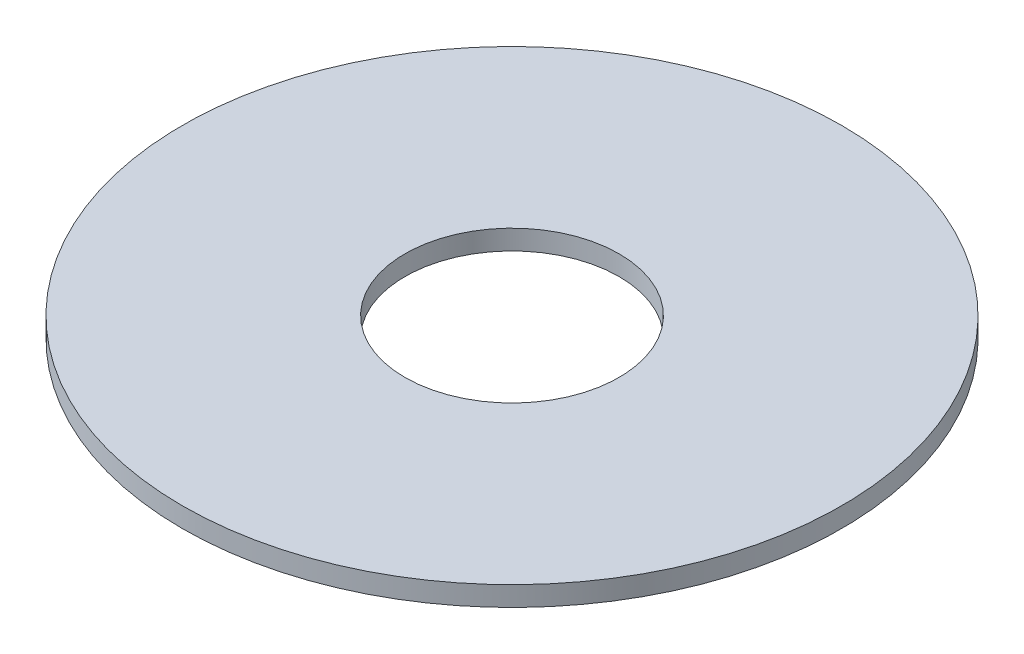
ISO-10303-21;
HEADER;
FILE_DESCRIPTION(('STEP AP214'),'2;1');
FILE_NAME('part.step','',(''),(''),'','','');
FILE_SCHEMA(('AUTOMOTIVE_DESIGN { 1 0 10303 214 1 1 1 1 }'));
ENDSEC;
DATA;
#1=APPLICATION_CONTEXT('core data for automotive mechanical design processes');
#2=APPLICATION_PROTOCOL_DEFINITION('international standard','automotive_design',2000,#1);
#3=PRODUCT_CONTEXT('',#1,'mechanical');
#4=PRODUCT('Part','Part','',(#3));
#5=PRODUCT_RELATED_PRODUCT_CATEGORY('part','',(#4));
#6=PRODUCT_DEFINITION_FORMATION('','',#4);
#7=PRODUCT_DEFINITION_CONTEXT('part definition',#1,'design');
#8=PRODUCT_DEFINITION('design','',#6,#7);
#9=PRODUCT_DEFINITION_SHAPE('','',#8);
#10=(LENGTH_UNIT() NAMED_UNIT(*) SI_UNIT(.MILLI.,.METRE.));
#11=(NAMED_UNIT(*) PLANE_ANGLE_UNIT() SI_UNIT($,.RADIAN.));
#12=(NAMED_UNIT(*) SI_UNIT($,.STERADIAN.) SOLID_ANGLE_UNIT());
#13=UNCERTAINTY_MEASURE_WITH_UNIT(LENGTH_MEASURE(1.E-05),#10,'distance_accuracy_value','');
#14=(GEOMETRIC_REPRESENTATION_CONTEXT(3) GLOBAL_UNCERTAINTY_ASSIGNED_CONTEXT((#13)) GLOBAL_UNIT_ASSIGNED_CONTEXT((#10,
#11,#12)) REPRESENTATION_CONTEXT('',''));
#15=CARTESIAN_POINT('',(0.,0.,0.));
#16=DIRECTION('',(0.,0.,1.));
#17=DIRECTION('',(1.,0.,0.));
#18=AXIS2_PLACEMENT_3D('',#15,#16,#17);
#19=CARTESIAN_POINT('',(0.,6.,0.));
#20=DIRECTION('',(0.,-1.,0.));
#21=DIRECTION('',(0.,0.,-1.));
#22=AXIS2_PLACEMENT_3D('',#19,#20,#21);
#23=CYLINDRICAL_SURFACE('',#22,100.);
#24=CARTESIAN_POINT('',(0.,6.,0.));
#25=DIRECTION('',(0.,1.,0.));
#26=DIRECTION('',(0.,0.,1.));
#27=AXIS2_PLACEMENT_3D('',#24,#25,#26);
#28=CIRCLE('',#27,100.);
#29=CARTESIAN_POINT('',(0.,6.,100.));
#30=VERTEX_POINT('',#29);
#31=EDGE_CURVE('E10',#30,#30,#28,.T.);
#32=ORIENTED_EDGE('',*,*,#31,.F.);
#33=EDGE_LOOP('',(#32));
#34=FACE_BOUND('',#33,.T.);
#35=CARTESIAN_POINT('',(0.,0.,0.));
#36=DIRECTION('',(0.,1.,0.));
#37=DIRECTION('',(0.,0.,1.));
#38=AXIS2_PLACEMENT_3D('',#35,#36,#37);
#39=CIRCLE('',#38,100.);
#40=CARTESIAN_POINT('',(0.,0.,100.));
#41=VERTEX_POINT('',#40);
#42=EDGE_CURVE('E37',#41,#41,#39,.T.);
#43=ORIENTED_EDGE('',*,*,#42,.T.);
#44=EDGE_LOOP('',(#43));
#45=FACE_BOUND('',#44,.T.);
#46=ADVANCED_FACE('F40',(#34,#45),#23,.T.);
#47=CARTESIAN_POINT('',(0.,6.,0.));
#48=DIRECTION('',(0.,1.,0.));
#49=DIRECTION('',(0.,0.,1.));
#50=AXIS2_PLACEMENT_3D('',#47,#48,#49);
#51=PLANE('',#50);
#52=CARTESIAN_POINT('',(0.,6.,0.));
#53=DIRECTION('',(0.,1.,0.));
#54=DIRECTION('',(0.,0.,1.));
#55=AXIS2_PLACEMENT_3D('',#52,#53,#54);
#56=CIRCLE('',#55,32.5);
#57=CARTESIAN_POINT('',(0.,6.,32.5));
#58=VERTEX_POINT('',#57);
#59=EDGE_CURVE('E50',#58,#58,#56,.T.);
#60=ORIENTED_EDGE('',*,*,#59,.F.);
#61=EDGE_LOOP('',(#60));
#62=FACE_BOUND('',#61,.T.);
#63=ORIENTED_EDGE('',*,*,#31,.T.);
#64=EDGE_LOOP('',(#63));
#65=FACE_BOUND('',#64,.T.);
#66=ADVANCED_FACE('F59',(#62,#65),#51,.T.);
#67=CARTESIAN_POINT('',(0.,0.,0.));
#68=DIRECTION('',(0.,1.,0.));
#69=DIRECTION('',(0.,0.,1.));
#70=AXIS2_PLACEMENT_3D('',#67,#68,#69);
#71=PLANE('',#70);
#72=CARTESIAN_POINT('',(0.,0.,0.));
#73=DIRECTION('',(0.,1.,0.));
#74=DIRECTION('',(0.,0.,1.));
#75=AXIS2_PLACEMENT_3D('',#72,#73,#74);
#76=CIRCLE('',#75,32.5);
#77=CARTESIAN_POINT('',(0.,0.,32.5));
#78=VERTEX_POINT('',#77);
#79=EDGE_CURVE('E47',#78,#78,#76,.T.);
#80=ORIENTED_EDGE('',*,*,#79,.T.);
#81=EDGE_LOOP('',(#80));
#82=FACE_BOUND('',#81,.T.);
#83=ORIENTED_EDGE('',*,*,#42,.F.);
#84=EDGE_LOOP('',(#83));
#85=FACE_BOUND('',#84,.T.);
#86=ADVANCED_FACE('F58',(#82,#85),#71,.F.);
#87=CARTESIAN_POINT('',(0.,6.,0.));
#88=DIRECTION('',(0.,-1.,0.));
#89=DIRECTION('',(0.,0.,-1.));
#90=AXIS2_PLACEMENT_3D('',#87,#88,#89);
#91=CYLINDRICAL_SURFACE('',#90,32.5);
#92=ORIENTED_EDGE('',*,*,#59,.T.);
#93=EDGE_LOOP('',(#92));
#94=FACE_BOUND('',#93,.T.);
#95=ORIENTED_EDGE('',*,*,#79,.F.);
#96=EDGE_LOOP('',(#95));
#97=FACE_BOUND('',#96,.T.);
#98=ADVANCED_FACE('F54',(#94,#97),#91,.F.);
#99=CLOSED_SHELL('',(#46,#66,#86,#98));
#100=MANIFOLD_SOLID_BREP('B2',#99);
#101=ADVANCED_BREP_SHAPE_REPRESENTATION('',(#18,#100),#14);
#102=SHAPE_DEFINITION_REPRESENTATION(#9,#101);
ENDSEC;
END-ISO-10303-21;
